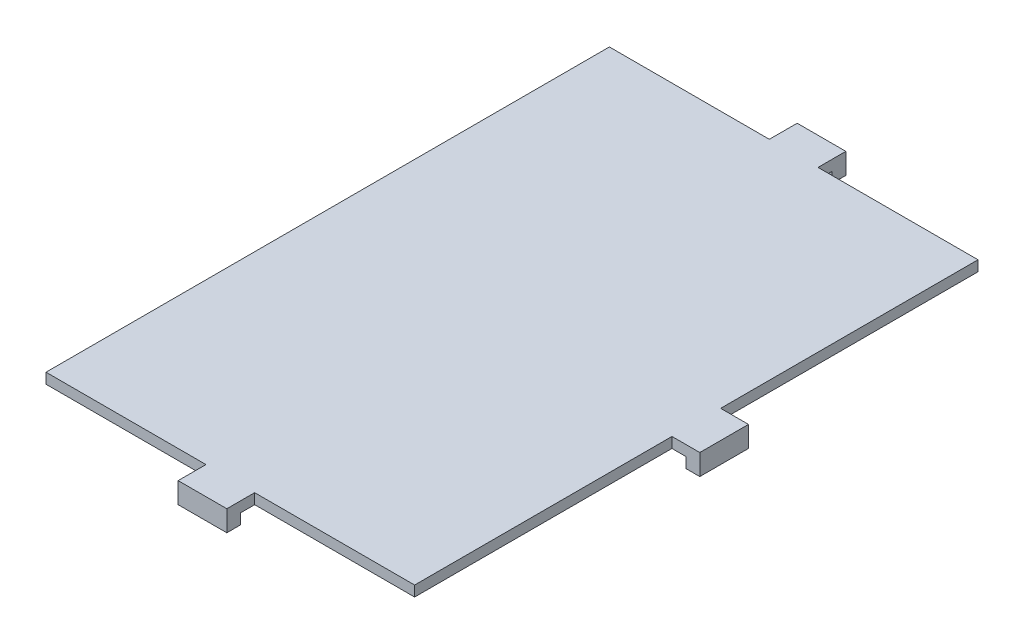
ISO-10303-21;
HEADER;
FILE_DESCRIPTION(('STEP AP214'),'2;1');
FILE_NAME('part.step','',(''),(''),'','','');
FILE_SCHEMA(('AUTOMOTIVE_DESIGN { 1 0 10303 214 1 1 1 1 }'));
ENDSEC;
DATA;
#1=APPLICATION_CONTEXT('core data for automotive mechanical design processes');
#2=APPLICATION_PROTOCOL_DEFINITION('international standard','automotive_design',2000,#1);
#3=PRODUCT_CONTEXT('',#1,'mechanical');
#4=PRODUCT('Part','Part','',(#3));
#5=PRODUCT_RELATED_PRODUCT_CATEGORY('part','',(#4));
#6=PRODUCT_DEFINITION_FORMATION('','',#4);
#7=PRODUCT_DEFINITION_CONTEXT('part definition',#1,'design');
#8=PRODUCT_DEFINITION('design','',#6,#7);
#9=PRODUCT_DEFINITION_SHAPE('','',#8);
#10=(LENGTH_UNIT() NAMED_UNIT(*) SI_UNIT(.MILLI.,.METRE.));
#11=(NAMED_UNIT(*) PLANE_ANGLE_UNIT() SI_UNIT($,.RADIAN.));
#12=(NAMED_UNIT(*) SI_UNIT($,.STERADIAN.) SOLID_ANGLE_UNIT());
#13=UNCERTAINTY_MEASURE_WITH_UNIT(LENGTH_MEASURE(1.E-05),#10,'distance_accuracy_value','');
#14=(GEOMETRIC_REPRESENTATION_CONTEXT(3) GLOBAL_UNCERTAINTY_ASSIGNED_CONTEXT((#13)) GLOBAL_UNIT_ASSIGNED_CONTEXT((#10,
#11,#12)) REPRESENTATION_CONTEXT('',''));
#15=CARTESIAN_POINT('',(0.,0.,0.));
#16=DIRECTION('',(0.,0.,1.));
#17=DIRECTION('',(1.,0.,0.));
#18=AXIS2_PLACEMENT_3D('',#15,#16,#17);
#19=CARTESIAN_POINT('',(0.,1.5,0.));
#20=DIRECTION('',(1.,0.,0.));
#21=DIRECTION('',(0.,0.,-1.));
#22=AXIS2_PLACEMENT_3D('',#19,#20,#21);
#23=PLANE('',#22);
#24=DIRECTION('',(0.,0.,1.));
#25=VECTOR('',#24,1.);
#26=CARTESIAN_POINT('',(0.,0.,0.));
#27=LINE('',#26,#25);
#28=CARTESIAN_POINT('',(0.,0.,-81.));
#29=VERTEX_POINT('',#28);
#30=CARTESIAN_POINT('',(0.,0.,0.));
#31=VERTEX_POINT('',#30);
#32=EDGE_CURVE('E169',#29,#31,#27,.T.);
#33=ORIENTED_EDGE('',*,*,#32,.T.);
#34=DIRECTION('',(0.,-1.,0.));
#35=VECTOR('',#34,1.);
#36=CARTESIAN_POINT('',(0.,1.5,0.));
#37=LINE('',#36,#35);
#38=CARTESIAN_POINT('',(0.,1.5,0.));
#39=VERTEX_POINT('',#38);
#40=EDGE_CURVE('E11',#39,#31,#37,.T.);
#41=ORIENTED_EDGE('',*,*,#40,.F.);
#42=DIRECTION('',(0.,0.,1.));
#43=VECTOR('',#42,1.);
#44=CARTESIAN_POINT('',(0.,1.5,0.));
#45=LINE('',#44,#43);
#46=CARTESIAN_POINT('',(0.,1.5,-81.));
#47=VERTEX_POINT('',#46);
#48=EDGE_CURVE('E203',#47,#39,#45,.T.);
#49=ORIENTED_EDGE('',*,*,#48,.F.);
#50=DIRECTION('',(0.,-1.,0.));
#51=VECTOR('',#50,1.);
#52=CARTESIAN_POINT('',(0.,1.5,-81.));
#53=LINE('',#52,#51);
#54=EDGE_CURVE('E168',#47,#29,#53,.T.);
#55=ORIENTED_EDGE('',*,*,#54,.T.);
#56=EDGE_LOOP('',(#33,#41,#49,#55));
#57=FACE_BOUND('',#56,.T.);
#58=ADVANCED_FACE('F36',(#57),#23,.F.);
#59=CARTESIAN_POINT('',(0.,1.5,0.));
#60=DIRECTION('',(0.,0.,-1.));
#61=DIRECTION('',(-1.,0.,0.));
#62=AXIS2_PLACEMENT_3D('',#59,#60,#61);
#63=PLANE('',#62);
#64=DIRECTION('',(1.,0.,0.));
#65=VECTOR('',#64,1.);
#66=CARTESIAN_POINT('',(0.,0.,0.));
#67=LINE('',#66,#65);
#68=CARTESIAN_POINT('',(23.,0.,0.));
#69=VERTEX_POINT('',#68);
#70=EDGE_CURVE('E172',#31,#69,#67,.T.);
#71=ORIENTED_EDGE('',*,*,#70,.T.);
#72=DIRECTION('',(0.,-1.,0.));
#73=VECTOR('',#72,1.);
#74=CARTESIAN_POINT('',(23.,1.5,0.));
#75=LINE('',#74,#73);
#76=CARTESIAN_POINT('',(23.,1.5,0.));
#77=VERTEX_POINT('',#76);
#78=EDGE_CURVE('E44',#77,#69,#75,.T.);
#79=ORIENTED_EDGE('',*,*,#78,.F.);
#80=DIRECTION('',(1.,0.,0.));
#81=VECTOR('',#80,1.);
#82=CARTESIAN_POINT('',(0.,1.5,0.));
#83=LINE('',#82,#81);
#84=EDGE_CURVE('E111',#39,#77,#83,.T.);
#85=ORIENTED_EDGE('',*,*,#84,.F.);
#86=ORIENTED_EDGE('',*,*,#40,.T.);
#87=EDGE_LOOP('',(#71,#79,#85,#86));
#88=FACE_BOUND('',#87,.T.);
#89=ADVANCED_FACE('F425',(#88),#63,.F.);
#90=CARTESIAN_POINT('',(23.,1.5,0.));
#91=DIRECTION('',(1.,0.,0.));
#92=DIRECTION('',(0.,0.,-1.));
#93=AXIS2_PLACEMENT_3D('',#90,#91,#92);
#94=PLANE('',#93);
#95=DIRECTION('',(0.,0.,1.));
#96=VECTOR('',#95,1.);
#97=CARTESIAN_POINT('',(23.,0.,0.));
#98=LINE('',#97,#96);
#99=CARTESIAN_POINT('',(23.,0.,2.));
#100=VERTEX_POINT('',#99);
#101=EDGE_CURVE('E175',#69,#100,#98,.T.);
#102=ORIENTED_EDGE('',*,*,#101,.T.);
#103=DIRECTION('',(0.,1.,0.));
#104=VECTOR('',#103,1.);
#105=CARTESIAN_POINT('',(23.,-1.5,2.));
#106=LINE('',#105,#104);
#107=CARTESIAN_POINT('',(23.,-1.5,2.));
#108=VERTEX_POINT('',#107);
#109=EDGE_CURVE('E239',#108,#100,#106,.T.);
#110=ORIENTED_EDGE('',*,*,#109,.F.);
#111=DIRECTION('',(0.,0.,1.));
#112=VECTOR('',#111,1.);
#113=CARTESIAN_POINT('',(23.,-1.5,2.));
#114=LINE('',#113,#112);
#115=CARTESIAN_POINT('',(23.,-1.5,4.));
#116=VERTEX_POINT('',#115);
#117=EDGE_CURVE('E590',#108,#116,#114,.T.);
#118=ORIENTED_EDGE('',*,*,#117,.T.);
#119=DIRECTION('',(0.,1.,0.));
#120=VECTOR('',#119,1.);
#121=CARTESIAN_POINT('',(23.,-1.5,4.));
#122=LINE('',#121,#120);
#123=CARTESIAN_POINT('',(23.,1.5,4.));
#124=VERTEX_POINT('',#123);
#125=EDGE_CURVE('E259',#116,#124,#122,.T.);
#126=ORIENTED_EDGE('',*,*,#125,.T.);
#127=DIRECTION('',(0.,0.,1.));
#128=VECTOR('',#127,1.);
#129=CARTESIAN_POINT('',(23.,1.5,0.));
#130=LINE('',#129,#128);
#131=EDGE_CURVE('E227',#77,#124,#130,.T.);
#132=ORIENTED_EDGE('',*,*,#131,.F.);
#133=ORIENTED_EDGE('',*,*,#78,.T.);
#134=EDGE_LOOP('',(#102,#110,#118,#126,#132,#133));
#135=FACE_BOUND('',#134,.T.);
#136=ADVANCED_FACE('F222',(#135),#94,.F.);
#137=CARTESIAN_POINT('',(30.,1.5,0.));
#138=DIRECTION('',(-1.,0.,0.));
#139=DIRECTION('',(0.,0.,1.));
#140=AXIS2_PLACEMENT_3D('',#137,#138,#139);
#141=PLANE('',#140);
#142=DIRECTION('',(0.,0.,-1.));
#143=VECTOR('',#142,1.);
#144=CARTESIAN_POINT('',(30.,0.,0.));
#145=LINE('',#144,#143);
#146=CARTESIAN_POINT('',(30.,0.,2.));
#147=VERTEX_POINT('',#146);
#148=CARTESIAN_POINT('',(30.,0.,0.));
#149=VERTEX_POINT('',#148);
#150=EDGE_CURVE('E180',#147,#149,#145,.T.);
#151=ORIENTED_EDGE('',*,*,#150,.T.);
#152=DIRECTION('',(0.,-1.,0.));
#153=VECTOR('',#152,1.);
#154=CARTESIAN_POINT('',(30.,1.5,0.));
#155=LINE('',#154,#153);
#156=CARTESIAN_POINT('',(30.,1.5,0.));
#157=VERTEX_POINT('',#156);
#158=EDGE_CURVE('E216',#157,#149,#155,.T.);
#159=ORIENTED_EDGE('',*,*,#158,.F.);
#160=DIRECTION('',(0.,0.,-1.));
#161=VECTOR('',#160,1.);
#162=CARTESIAN_POINT('',(30.,1.5,0.));
#163=LINE('',#162,#161);
#164=CARTESIAN_POINT('',(30.,1.5,4.));
#165=VERTEX_POINT('',#164);
#166=EDGE_CURVE('E309',#165,#157,#163,.T.);
#167=ORIENTED_EDGE('',*,*,#166,.F.);
#168=DIRECTION('',(0.,1.,0.));
#169=VECTOR('',#168,1.);
#170=CARTESIAN_POINT('',(30.,-1.5,4.));
#171=LINE('',#170,#169);
#172=CARTESIAN_POINT('',(30.,-1.5,4.));
#173=VERTEX_POINT('',#172);
#174=EDGE_CURVE('E251',#173,#165,#171,.T.);
#175=ORIENTED_EDGE('',*,*,#174,.F.);
#176=DIRECTION('',(0.,0.,-1.));
#177=VECTOR('',#176,1.);
#178=CARTESIAN_POINT('',(30.,-1.5,2.));
#179=LINE('',#178,#177);
#180=CARTESIAN_POINT('',(30.,-1.5,2.));
#181=VERTEX_POINT('',#180);
#182=EDGE_CURVE('E399',#173,#181,#179,.T.);
#183=ORIENTED_EDGE('',*,*,#182,.T.);
#184=DIRECTION('',(0.,1.,0.));
#185=VECTOR('',#184,1.);
#186=CARTESIAN_POINT('',(30.,-1.5,2.));
#187=LINE('',#186,#185);
#188=EDGE_CURVE('E247',#181,#147,#187,.T.);
#189=ORIENTED_EDGE('',*,*,#188,.T.);
#190=EDGE_LOOP('',(#151,#159,#167,#175,#183,#189));
#191=FACE_BOUND('',#190,.T.);
#192=ADVANCED_FACE('F393',(#191),#141,.F.);
#193=CARTESIAN_POINT('',(30.,1.5,0.));
#194=DIRECTION('',(0.,0.,-1.));
#195=DIRECTION('',(-1.,0.,0.));
#196=AXIS2_PLACEMENT_3D('',#193,#194,#195);
#197=PLANE('',#196);
#198=DIRECTION('',(1.,0.,0.));
#199=VECTOR('',#198,1.);
#200=CARTESIAN_POINT('',(30.,0.,0.));
#201=LINE('',#200,#199);
#202=CARTESIAN_POINT('',(53.,0.,0.));
#203=VERTEX_POINT('',#202);
#204=EDGE_CURVE('E182',#149,#203,#201,.T.);
#205=ORIENTED_EDGE('',*,*,#204,.T.);
#206=DIRECTION('',(0.,-1.,0.));
#207=VECTOR('',#206,1.);
#208=CARTESIAN_POINT('',(53.,1.5,0.));
#209=LINE('',#208,#207);
#210=CARTESIAN_POINT('',(53.,1.5,0.));
#211=VERTEX_POINT('',#210);
#212=EDGE_CURVE('E213',#211,#203,#209,.T.);
#213=ORIENTED_EDGE('',*,*,#212,.F.);
#214=DIRECTION('',(1.,0.,0.));
#215=VECTOR('',#214,1.);
#216=CARTESIAN_POINT('',(30.,1.5,0.));
#217=LINE('',#216,#215);
#218=EDGE_CURVE('E311',#157,#211,#217,.T.);
#219=ORIENTED_EDGE('',*,*,#218,.F.);
#220=ORIENTED_EDGE('',*,*,#158,.T.);
#221=EDGE_LOOP('',(#205,#213,#219,#220));
#222=FACE_BOUND('',#221,.T.);
#223=ADVANCED_FACE('F389',(#222),#197,.F.);
#224=CARTESIAN_POINT('',(53.,1.5,0.));
#225=DIRECTION('',(-1.,0.,0.));
#226=DIRECTION('',(0.,0.,1.));
#227=AXIS2_PLACEMENT_3D('',#224,#225,#226);
#228=PLANE('',#227);
#229=DIRECTION('',(0.,0.,-1.));
#230=VECTOR('',#229,1.);
#231=CARTESIAN_POINT('',(53.,0.,0.));
#232=LINE('',#231,#230);
#233=CARTESIAN_POINT('',(53.,0.,-37.));
#234=VERTEX_POINT('',#233);
#235=EDGE_CURVE('E184',#203,#234,#232,.T.);
#236=ORIENTED_EDGE('',*,*,#235,.T.);
#237=DIRECTION('',(0.,-1.,0.));
#238=VECTOR('',#237,1.);
#239=CARTESIAN_POINT('',(53.,1.5,-37.));
#240=LINE('',#239,#238);
#241=CARTESIAN_POINT('',(53.,1.5,-37.));
#242=VERTEX_POINT('',#241);
#243=EDGE_CURVE('E210',#242,#234,#240,.T.);
#244=ORIENTED_EDGE('',*,*,#243,.F.);
#245=DIRECTION('',(0.,0.,-1.));
#246=VECTOR('',#245,1.);
#247=CARTESIAN_POINT('',(53.,1.5,0.));
#248=LINE('',#247,#246);
#249=EDGE_CURVE('E313',#211,#242,#248,.T.);
#250=ORIENTED_EDGE('',*,*,#249,.F.);
#251=ORIENTED_EDGE('',*,*,#212,.T.);
#252=EDGE_LOOP('',(#236,#244,#250,#251));
#253=FACE_BOUND('',#252,.T.);
#254=ADVANCED_FACE('F384',(#253),#228,.F.);
#255=CARTESIAN_POINT('',(53.,1.5,-37.));
#256=DIRECTION('',(0.,0.,-1.));
#257=DIRECTION('',(-1.,0.,0.));
#258=AXIS2_PLACEMENT_3D('',#255,#256,#257);
#259=PLANE('',#258);
#260=DIRECTION('',(1.,0.,0.));
#261=VECTOR('',#260,1.);
#262=CARTESIAN_POINT('',(53.,0.,-37.));
#263=LINE('',#262,#261);
#264=CARTESIAN_POINT('',(55.,0.,-37.));
#265=VERTEX_POINT('',#264);
#266=EDGE_CURVE('E186',#234,#265,#263,.T.);
#267=ORIENTED_EDGE('',*,*,#266,.T.);
#268=DIRECTION('',(0.,1.,0.));
#269=VECTOR('',#268,1.);
#270=CARTESIAN_POINT('',(55.,-1.5,-37.));
#271=LINE('',#270,#269);
#272=CARTESIAN_POINT('',(55.,-1.5,-37.));
#273=VERTEX_POINT('',#272);
#274=EDGE_CURVE('E293',#273,#265,#271,.T.);
#275=ORIENTED_EDGE('',*,*,#274,.F.);
#276=DIRECTION('',(1.,0.,0.));
#277=VECTOR('',#276,1.);
#278=CARTESIAN_POINT('',(55.,-1.5,-37.));
#279=LINE('',#278,#277);
#280=CARTESIAN_POINT('',(57.,-1.5,-37.));
#281=VERTEX_POINT('',#280);
#282=EDGE_CURVE('E284',#273,#281,#279,.T.);
#283=ORIENTED_EDGE('',*,*,#282,.T.);
#284=DIRECTION('',(0.,1.,0.));
#285=VECTOR('',#284,1.);
#286=CARTESIAN_POINT('',(57.,-1.5,-37.));
#287=LINE('',#286,#285);
#288=CARTESIAN_POINT('',(57.,1.5,-37.));
#289=VERTEX_POINT('',#288);
#290=EDGE_CURVE('E301',#281,#289,#287,.T.);
#291=ORIENTED_EDGE('',*,*,#290,.T.);
#292=DIRECTION('',(1.,0.,0.));
#293=VECTOR('',#292,1.);
#294=CARTESIAN_POINT('',(53.,1.5,-37.));
#295=LINE('',#294,#293);
#296=EDGE_CURVE('E315',#242,#289,#295,.T.);
#297=ORIENTED_EDGE('',*,*,#296,.F.);
#298=ORIENTED_EDGE('',*,*,#243,.T.);
#299=EDGE_LOOP('',(#267,#275,#283,#291,#297,#298));
#300=FACE_BOUND('',#299,.T.);
#301=ADVANCED_FACE('F379',(#300),#259,.F.);
#302=CARTESIAN_POINT('',(53.,1.5,-44.));
#303=DIRECTION('',(0.,0.,1.));
#304=DIRECTION('',(1.,0.,0.));
#305=AXIS2_PLACEMENT_3D('',#302,#303,#304);
#306=PLANE('',#305);
#307=DIRECTION('',(-1.,0.,0.));
#308=VECTOR('',#307,1.);
#309=CARTESIAN_POINT('',(53.,0.,-44.));
#310=LINE('',#309,#308);
#311=CARTESIAN_POINT('',(55.,0.,-44.));
#312=VERTEX_POINT('',#311);
#313=CARTESIAN_POINT('',(53.,0.,-44.));
#314=VERTEX_POINT('',#313);
#315=EDGE_CURVE('E191',#312,#314,#310,.T.);
#316=ORIENTED_EDGE('',*,*,#315,.T.);
#317=DIRECTION('',(0.,-1.,0.));
#318=VECTOR('',#317,1.);
#319=CARTESIAN_POINT('',(53.,1.5,-44.));
#320=LINE('',#319,#318);
#321=CARTESIAN_POINT('',(53.,1.5,-44.));
#322=VERTEX_POINT('',#321);
#323=EDGE_CURVE('E207',#322,#314,#320,.T.);
#324=ORIENTED_EDGE('',*,*,#323,.F.);
#325=DIRECTION('',(-1.,0.,0.));
#326=VECTOR('',#325,1.);
#327=CARTESIAN_POINT('',(53.,1.5,-44.));
#328=LINE('',#327,#326);
#329=CARTESIAN_POINT('',(57.,1.5,-44.));
#330=VERTEX_POINT('',#329);
#331=EDGE_CURVE('E318',#330,#322,#328,.T.);
#332=ORIENTED_EDGE('',*,*,#331,.F.);
#333=DIRECTION('',(0.,1.,0.));
#334=VECTOR('',#333,1.);
#335=CARTESIAN_POINT('',(57.,-1.5,-44.));
#336=LINE('',#335,#334);
#337=CARTESIAN_POINT('',(57.,-1.5,-44.));
#338=VERTEX_POINT('',#337);
#339=EDGE_CURVE('E298',#338,#330,#336,.T.);
#340=ORIENTED_EDGE('',*,*,#339,.F.);
#341=DIRECTION('',(-1.,0.,0.));
#342=VECTOR('',#341,1.);
#343=CARTESIAN_POINT('',(55.,-1.5,-44.));
#344=LINE('',#343,#342);
#345=CARTESIAN_POINT('',(55.,-1.5,-44.));
#346=VERTEX_POINT('',#345);
#347=EDGE_CURVE('E290',#338,#346,#344,.T.);
#348=ORIENTED_EDGE('',*,*,#347,.T.);
#349=DIRECTION('',(0.,1.,0.));
#350=VECTOR('',#349,1.);
#351=CARTESIAN_POINT('',(55.,-1.5,-44.));
#352=LINE('',#351,#350);
#353=EDGE_CURVE('E173',#346,#312,#352,.T.);
#354=ORIENTED_EDGE('',*,*,#353,.T.);
#355=EDGE_LOOP('',(#316,#324,#332,#340,#348,#354));
#356=FACE_BOUND('',#355,.T.);
#357=ADVANCED_FACE('F325',(#356),#306,.F.);
#358=CARTESIAN_POINT('',(53.,1.5,-44.));
#359=DIRECTION('',(-1.,0.,0.));
#360=DIRECTION('',(0.,0.,1.));
#361=AXIS2_PLACEMENT_3D('',#358,#359,#360);
#362=PLANE('',#361);
#363=DIRECTION('',(0.,0.,-1.));
#364=VECTOR('',#363,1.);
#365=CARTESIAN_POINT('',(53.,0.,-44.));
#366=LINE('',#365,#364);
#367=CARTESIAN_POINT('',(53.,0.,-81.));
#368=VERTEX_POINT('',#367);
#369=EDGE_CURVE('E193',#314,#368,#366,.T.);
#370=ORIENTED_EDGE('',*,*,#369,.T.);
#371=DIRECTION('',(0.,-1.,0.));
#372=VECTOR('',#371,1.);
#373=CARTESIAN_POINT('',(53.,1.5,-81.));
#374=LINE('',#373,#372);
#375=CARTESIAN_POINT('',(53.,1.5,-81.));
#376=VERTEX_POINT('',#375);
#377=EDGE_CURVE('E154',#376,#368,#374,.T.);
#378=ORIENTED_EDGE('',*,*,#377,.F.);
#379=DIRECTION('',(0.,0.,-1.));
#380=VECTOR('',#379,1.);
#381=CARTESIAN_POINT('',(53.,1.5,-44.));
#382=LINE('',#381,#380);
#383=EDGE_CURVE('E142',#322,#376,#382,.T.);
#384=ORIENTED_EDGE('',*,*,#383,.F.);
#385=ORIENTED_EDGE('',*,*,#323,.T.);
#386=EDGE_LOOP('',(#370,#378,#384,#385));
#387=FACE_BOUND('',#386,.T.);
#388=ADVANCED_FACE('F329',(#387),#362,.F.);
#389=CARTESIAN_POINT('',(30.,1.5,-81.));
#390=DIRECTION('',(0.,0.,1.));
#391=DIRECTION('',(1.,0.,0.));
#392=AXIS2_PLACEMENT_3D('',#389,#390,#391);
#393=PLANE('',#392);
#394=DIRECTION('',(-1.,0.,0.));
#395=VECTOR('',#394,1.);
#396=CARTESIAN_POINT('',(30.,0.,-81.));
#397=LINE('',#396,#395);
#398=CARTESIAN_POINT('',(30.,0.,-81.));
#399=VERTEX_POINT('',#398);
#400=EDGE_CURVE('E151',#368,#399,#397,.T.);
#401=ORIENTED_EDGE('',*,*,#400,.T.);
#402=DIRECTION('',(0.,-1.,0.));
#403=VECTOR('',#402,1.);
#404=CARTESIAN_POINT('',(30.,1.5,-81.));
#405=LINE('',#404,#403);
#406=CARTESIAN_POINT('',(30.,1.5,-81.));
#407=VERTEX_POINT('',#406);
#408=EDGE_CURVE('E148',#407,#399,#405,.T.);
#409=ORIENTED_EDGE('',*,*,#408,.F.);
#410=DIRECTION('',(-1.,0.,0.));
#411=VECTOR('',#410,1.);
#412=CARTESIAN_POINT('',(30.,1.5,-81.));
#413=LINE('',#412,#411);
#414=EDGE_CURVE('E133',#376,#407,#413,.T.);
#415=ORIENTED_EDGE('',*,*,#414,.F.);
#416=ORIENTED_EDGE('',*,*,#377,.T.);
#417=EDGE_LOOP('',(#401,#409,#415,#416));
#418=FACE_BOUND('',#417,.T.);
#419=ADVANCED_FACE('F149',(#418),#393,.F.);
#420=CARTESIAN_POINT('',(30.,1.5,-83.));
#421=DIRECTION('',(-1.,0.,0.));
#422=DIRECTION('',(0.,0.,1.));
#423=AXIS2_PLACEMENT_3D('',#420,#421,#422);
#424=PLANE('',#423);
#425=DIRECTION('',(0.,0.,-1.));
#426=VECTOR('',#425,1.);
#427=CARTESIAN_POINT('',(30.,0.,-83.));
#428=LINE('',#427,#426);
#429=CARTESIAN_POINT('',(30.,0.,-83.));
#430=VERTEX_POINT('',#429);
#431=EDGE_CURVE('E196',#399,#430,#428,.T.);
#432=ORIENTED_EDGE('',*,*,#431,.T.);
#433=DIRECTION('',(0.,1.,0.));
#434=VECTOR('',#433,1.);
#435=CARTESIAN_POINT('',(30.,-1.5,-83.));
#436=LINE('',#435,#434);
#437=CARTESIAN_POINT('',(30.,-1.5,-83.));
#438=VERTEX_POINT('',#437);
#439=EDGE_CURVE('E277',#438,#430,#436,.T.);
#440=ORIENTED_EDGE('',*,*,#439,.F.);
#441=DIRECTION('',(0.,0.,-1.));
#442=VECTOR('',#441,1.);
#443=CARTESIAN_POINT('',(30.,-1.5,-83.));
#444=LINE('',#443,#442);
#445=CARTESIAN_POINT('',(30.,-1.5,-85.));
#446=VERTEX_POINT('',#445);
#447=EDGE_CURVE('E266',#438,#446,#444,.T.);
#448=ORIENTED_EDGE('',*,*,#447,.T.);
#449=DIRECTION('',(0.,1.,0.));
#450=VECTOR('',#449,1.);
#451=CARTESIAN_POINT('',(30.,-1.5,-85.));
#452=LINE('',#451,#450);
#453=CARTESIAN_POINT('',(30.,1.5,-85.));
#454=VERTEX_POINT('',#453);
#455=EDGE_CURVE('E160',#446,#454,#452,.T.);
#456=ORIENTED_EDGE('',*,*,#455,.T.);
#457=DIRECTION('',(0.,0.,-1.));
#458=VECTOR('',#457,1.);
#459=CARTESIAN_POINT('',(30.,1.5,-83.));
#460=LINE('',#459,#458);
#461=EDGE_CURVE('E139',#407,#454,#460,.T.);
#462=ORIENTED_EDGE('',*,*,#461,.F.);
#463=ORIENTED_EDGE('',*,*,#408,.T.);
#464=EDGE_LOOP('',(#432,#440,#448,#456,#462,#463));
#465=FACE_BOUND('',#464,.T.);
#466=ADVANCED_FACE('F157',(#465),#424,.F.);
#467=CARTESIAN_POINT('',(23.,1.5,-83.));
#468=DIRECTION('',(1.,0.,0.));
#469=DIRECTION('',(0.,0.,-1.));
#470=AXIS2_PLACEMENT_3D('',#467,#468,#469);
#471=PLANE('',#470);
#472=DIRECTION('',(0.,0.,1.));
#473=VECTOR('',#472,1.);
#474=CARTESIAN_POINT('',(23.,0.,-83.));
#475=LINE('',#474,#473);
#476=CARTESIAN_POINT('',(23.,0.,-83.));
#477=VERTEX_POINT('',#476);
#478=CARTESIAN_POINT('',(23.,0.,-81.));
#479=VERTEX_POINT('',#478);
#480=EDGE_CURVE('E97',#477,#479,#475,.T.);
#481=ORIENTED_EDGE('',*,*,#480,.T.);
#482=DIRECTION('',(0.,-1.,0.));
#483=VECTOR('',#482,1.);
#484=CARTESIAN_POINT('',(23.,1.5,-81.));
#485=LINE('',#484,#483);
#486=CARTESIAN_POINT('',(23.,1.5,-81.));
#487=VERTEX_POINT('',#486);
#488=EDGE_CURVE('E155',#487,#479,#485,.T.);
#489=ORIENTED_EDGE('',*,*,#488,.F.);
#490=DIRECTION('',(0.,0.,1.));
#491=VECTOR('',#490,1.);
#492=CARTESIAN_POINT('',(23.,1.5,-83.));
#493=LINE('',#492,#491);
#494=CARTESIAN_POINT('',(23.,1.5,-85.));
#495=VERTEX_POINT('',#494);
#496=EDGE_CURVE('E162',#495,#487,#493,.T.);
#497=ORIENTED_EDGE('',*,*,#496,.F.);
#498=DIRECTION('',(0.,1.,0.));
#499=VECTOR('',#498,1.);
#500=CARTESIAN_POINT('',(23.,-1.5,-85.));
#501=LINE('',#500,#499);
#502=CARTESIAN_POINT('',(23.,-1.5,-85.));
#503=VERTEX_POINT('',#502);
#504=EDGE_CURVE('E272',#503,#495,#501,.T.);
#505=ORIENTED_EDGE('',*,*,#504,.F.);
#506=DIRECTION('',(0.,0.,1.));
#507=VECTOR('',#506,1.);
#508=CARTESIAN_POINT('',(23.,-1.5,-83.));
#509=LINE('',#508,#507);
#510=CARTESIAN_POINT('',(23.,-1.5,-83.));
#511=VERTEX_POINT('',#510);
#512=EDGE_CURVE('E249',#503,#511,#509,.T.);
#513=ORIENTED_EDGE('',*,*,#512,.T.);
#514=DIRECTION('',(0.,1.,0.));
#515=VECTOR('',#514,1.);
#516=CARTESIAN_POINT('',(23.,-1.5,-83.));
#517=LINE('',#516,#515);
#518=EDGE_CURVE('E270',#511,#477,#517,.T.);
#519=ORIENTED_EDGE('',*,*,#518,.T.);
#520=EDGE_LOOP('',(#481,#489,#497,#505,#513,#519));
#521=FACE_BOUND('',#520,.T.);
#522=ADVANCED_FACE('F348',(#521),#471,.F.);
#523=CARTESIAN_POINT('',(0.,1.5,-81.));
#524=DIRECTION('',(0.,0.,1.));
#525=DIRECTION('',(1.,0.,0.));
#526=AXIS2_PLACEMENT_3D('',#523,#524,#525);
#527=PLANE('',#526);
#528=DIRECTION('',(-1.,0.,0.));
#529=VECTOR('',#528,1.);
#530=CARTESIAN_POINT('',(0.,0.,-81.));
#531=LINE('',#530,#529);
#532=EDGE_CURVE('E103',#479,#29,#531,.T.);
#533=ORIENTED_EDGE('',*,*,#532,.T.);
#534=ORIENTED_EDGE('',*,*,#54,.F.);
#535=DIRECTION('',(-1.,0.,0.));
#536=VECTOR('',#535,1.);
#537=CARTESIAN_POINT('',(0.,1.5,-81.));
#538=LINE('',#537,#536);
#539=EDGE_CURVE('E52',#487,#47,#538,.T.);
#540=ORIENTED_EDGE('',*,*,#539,.F.);
#541=ORIENTED_EDGE('',*,*,#488,.T.);
#542=EDGE_LOOP('',(#533,#534,#540,#541));
#543=FACE_BOUND('',#542,.T.);
#544=ADVANCED_FACE('F432',(#543),#527,.F.);
#545=CARTESIAN_POINT('',(0.,1.5,0.));
#546=DIRECTION('',(0.,-1.,0.));
#547=DIRECTION('',(0.,0.,-1.));
#548=AXIS2_PLACEMENT_3D('',#545,#546,#547);
#549=PLANE('',#548);
#550=ORIENTED_EDGE('',*,*,#48,.T.);
#551=ORIENTED_EDGE('',*,*,#84,.T.);
#552=ORIENTED_EDGE('',*,*,#131,.T.);
#553=DIRECTION('',(1.,0.,0.));
#554=VECTOR('',#553,1.);
#555=CARTESIAN_POINT('',(23.,1.5,4.));
#556=LINE('',#555,#554);
#557=EDGE_CURVE('E254',#124,#165,#556,.T.);
#558=ORIENTED_EDGE('',*,*,#557,.T.);
#559=ORIENTED_EDGE('',*,*,#166,.T.);
#560=ORIENTED_EDGE('',*,*,#218,.T.);
#561=ORIENTED_EDGE('',*,*,#249,.T.);
#562=ORIENTED_EDGE('',*,*,#296,.T.);
#563=DIRECTION('',(0.,0.,-1.));
#564=VECTOR('',#563,1.);
#565=CARTESIAN_POINT('',(57.,1.5,-44.));
#566=LINE('',#565,#564);
#567=EDGE_CURVE('E275',#289,#330,#566,.T.);
#568=ORIENTED_EDGE('',*,*,#567,.T.);
#569=ORIENTED_EDGE('',*,*,#331,.T.);
#570=ORIENTED_EDGE('',*,*,#383,.T.);
#571=ORIENTED_EDGE('',*,*,#414,.T.);
#572=ORIENTED_EDGE('',*,*,#461,.T.);
#573=DIRECTION('',(-1.,0.,0.));
#574=VECTOR('',#573,1.);
#575=CARTESIAN_POINT('',(23.,1.5,-85.));
#576=LINE('',#575,#574);
#577=EDGE_CURVE('E246',#454,#495,#576,.T.);
#578=ORIENTED_EDGE('',*,*,#577,.T.);
#579=ORIENTED_EDGE('',*,*,#496,.T.);
#580=ORIENTED_EDGE('',*,*,#539,.T.);
#581=EDGE_LOOP('',(#550,#551,#552,#558,#559,#560,#561,#562,#568,#569,#570,#571,#572,#578,#579,#580));
#582=FACE_BOUND('',#581,.T.);
#583=ADVANCED_FACE('F135',(#582),#549,.F.);
#584=CARTESIAN_POINT('',(0.,0.,0.));
#585=DIRECTION('',(0.,-1.,0.));
#586=DIRECTION('',(0.,0.,-1.));
#587=AXIS2_PLACEMENT_3D('',#584,#585,#586);
#588=PLANE('',#587);
#589=ORIENTED_EDGE('',*,*,#32,.F.);
#590=ORIENTED_EDGE('',*,*,#532,.F.);
#591=ORIENTED_EDGE('',*,*,#480,.F.);
#592=DIRECTION('',(-1.,0.,0.));
#593=VECTOR('',#592,1.);
#594=CARTESIAN_POINT('',(23.,0.,-83.));
#595=LINE('',#594,#593);
#596=EDGE_CURVE('E198',#430,#477,#595,.T.);
#597=ORIENTED_EDGE('',*,*,#596,.F.);
#598=ORIENTED_EDGE('',*,*,#431,.F.);
#599=ORIENTED_EDGE('',*,*,#400,.F.);
#600=ORIENTED_EDGE('',*,*,#369,.F.);
#601=ORIENTED_EDGE('',*,*,#315,.F.);
#602=DIRECTION('',(0.,0.,-1.));
#603=VECTOR('',#602,1.);
#604=CARTESIAN_POINT('',(55.,0.,-44.));
#605=LINE('',#604,#603);
#606=EDGE_CURVE('E188',#265,#312,#605,.T.);
#607=ORIENTED_EDGE('',*,*,#606,.F.);
#608=ORIENTED_EDGE('',*,*,#266,.F.);
#609=ORIENTED_EDGE('',*,*,#235,.F.);
#610=ORIENTED_EDGE('',*,*,#204,.F.);
#611=ORIENTED_EDGE('',*,*,#150,.F.);
#612=DIRECTION('',(1.,0.,0.));
#613=VECTOR('',#612,1.);
#614=CARTESIAN_POINT('',(23.,0.,2.));
#615=LINE('',#614,#613);
#616=EDGE_CURVE('E177',#100,#147,#615,.T.);
#617=ORIENTED_EDGE('',*,*,#616,.F.);
#618=ORIENTED_EDGE('',*,*,#101,.F.);
#619=ORIENTED_EDGE('',*,*,#70,.F.);
#620=EDGE_LOOP('',(#589,#590,#591,#597,#598,#599,#600,#601,#607,#608,#609,#610,#611,#617,#618,#619));
#621=FACE_BOUND('',#620,.T.);
#622=ADVANCED_FACE('F230',(#621),#588,.T.);
#623=CARTESIAN_POINT('',(55.,-1.5,-44.));
#624=DIRECTION('',(-1.,0.,0.));
#625=DIRECTION('',(0.,0.,1.));
#626=AXIS2_PLACEMENT_3D('',#623,#624,#625);
#627=PLANE('',#626);
#628=ORIENTED_EDGE('',*,*,#274,.T.);
#629=ORIENTED_EDGE('',*,*,#606,.T.);
#630=ORIENTED_EDGE('',*,*,#353,.F.);
#631=DIRECTION('',(0.,0.,1.));
#632=VECTOR('',#631,1.);
#633=CARTESIAN_POINT('',(55.,-1.5,-44.));
#634=LINE('',#633,#632);
#635=EDGE_CURVE('E281',#346,#273,#634,.T.);
#636=ORIENTED_EDGE('',*,*,#635,.T.);
#637=EDGE_LOOP('',(#628,#629,#630,#636));
#638=FACE_BOUND('',#637,.T.);
#639=ADVANCED_FACE('F372',(#638),#627,.T.);
#640=CARTESIAN_POINT('',(57.,-1.5,-44.));
#641=DIRECTION('',(1.,0.,0.));
#642=DIRECTION('',(0.,0.,-1.));
#643=AXIS2_PLACEMENT_3D('',#640,#641,#642);
#644=PLANE('',#643);
#645=ORIENTED_EDGE('',*,*,#567,.F.);
#646=ORIENTED_EDGE('',*,*,#290,.F.);
#647=DIRECTION('',(0.,0.,-1.));
#648=VECTOR('',#647,1.);
#649=CARTESIAN_POINT('',(57.,-1.5,-44.));
#650=LINE('',#649,#648);
#651=EDGE_CURVE('E287',#281,#338,#650,.T.);
#652=ORIENTED_EDGE('',*,*,#651,.T.);
#653=ORIENTED_EDGE('',*,*,#339,.T.);
#654=EDGE_LOOP('',(#645,#646,#652,#653));
#655=FACE_BOUND('',#654,.T.);
#656=ADVANCED_FACE('F421',(#655),#644,.T.);
#657=CARTESIAN_POINT('',(0.,-1.5,0.));
#658=DIRECTION('',(0.,1.,0.));
#659=DIRECTION('',(0.,0.,1.));
#660=AXIS2_PLACEMENT_3D('',#657,#658,#659);
#661=PLANE('',#660);
#662=ORIENTED_EDGE('',*,*,#635,.F.);
#663=ORIENTED_EDGE('',*,*,#347,.F.);
#664=ORIENTED_EDGE('',*,*,#651,.F.);
#665=ORIENTED_EDGE('',*,*,#282,.F.);
#666=EDGE_LOOP('',(#662,#663,#664,#665));
#667=FACE_BOUND('',#666,.T.);
#668=ADVANCED_FACE('F376',(#667),#661,.F.);
#669=CARTESIAN_POINT('',(23.,-1.5,-85.));
#670=DIRECTION('',(0.,0.,-1.));
#671=DIRECTION('',(-1.,0.,0.));
#672=AXIS2_PLACEMENT_3D('',#669,#670,#671);
#673=PLANE('',#672);
#674=ORIENTED_EDGE('',*,*,#577,.F.);
#675=ORIENTED_EDGE('',*,*,#455,.F.);
#676=DIRECTION('',(-1.,0.,0.));
#677=VECTOR('',#676,1.);
#678=CARTESIAN_POINT('',(23.,-1.5,-85.));
#679=LINE('',#678,#677);
#680=EDGE_CURVE('E268',#446,#503,#679,.T.);
#681=ORIENTED_EDGE('',*,*,#680,.T.);
#682=ORIENTED_EDGE('',*,*,#504,.T.);
#683=EDGE_LOOP('',(#674,#675,#681,#682));
#684=FACE_BOUND('',#683,.T.);
#685=ADVANCED_FACE('F413',(#684),#673,.T.);
#686=CARTESIAN_POINT('',(23.,-1.5,-83.));
#687=DIRECTION('',(0.,0.,1.));
#688=DIRECTION('',(1.,0.,0.));
#689=AXIS2_PLACEMENT_3D('',#686,#687,#688);
#690=PLANE('',#689);
#691=ORIENTED_EDGE('',*,*,#439,.T.);
#692=ORIENTED_EDGE('',*,*,#596,.T.);
#693=ORIENTED_EDGE('',*,*,#518,.F.);
#694=DIRECTION('',(1.,0.,0.));
#695=VECTOR('',#694,1.);
#696=CARTESIAN_POINT('',(23.,-1.5,-83.));
#697=LINE('',#696,#695);
#698=EDGE_CURVE('E263',#511,#438,#697,.T.);
#699=ORIENTED_EDGE('',*,*,#698,.T.);
#700=EDGE_LOOP('',(#691,#692,#693,#699));
#701=FACE_BOUND('',#700,.T.);
#702=ADVANCED_FACE('F344',(#701),#690,.T.);
#703=CARTESIAN_POINT('',(0.,-1.5,0.));
#704=DIRECTION('',(0.,-1.,0.));
#705=DIRECTION('',(0.,0.,-1.));
#706=AXIS2_PLACEMENT_3D('',#703,#704,#705);
#707=PLANE('',#706);
#708=ORIENTED_EDGE('',*,*,#512,.F.);
#709=ORIENTED_EDGE('',*,*,#680,.F.);
#710=ORIENTED_EDGE('',*,*,#447,.F.);
#711=ORIENTED_EDGE('',*,*,#698,.F.);
#712=EDGE_LOOP('',(#708,#709,#710,#711));
#713=FACE_BOUND('',#712,.T.);
#714=ADVANCED_FACE('F342',(#713),#707,.T.);
#715=CARTESIAN_POINT('',(23.,-1.5,2.));
#716=DIRECTION('',(0.,0.,-1.));
#717=DIRECTION('',(-1.,0.,0.));
#718=AXIS2_PLACEMENT_3D('',#715,#716,#717);
#719=PLANE('',#718);
#720=ORIENTED_EDGE('',*,*,#109,.T.);
#721=ORIENTED_EDGE('',*,*,#616,.T.);
#722=ORIENTED_EDGE('',*,*,#188,.F.);
#723=DIRECTION('',(-1.,0.,0.));
#724=VECTOR('',#723,1.);
#725=CARTESIAN_POINT('',(23.,-1.5,2.));
#726=LINE('',#725,#724);
#727=EDGE_CURVE('E243',#181,#108,#726,.T.);
#728=ORIENTED_EDGE('',*,*,#727,.T.);
#729=EDGE_LOOP('',(#720,#721,#722,#728));
#730=FACE_BOUND('',#729,.T.);
#731=ADVANCED_FACE('F240',(#730),#719,.T.);
#732=CARTESIAN_POINT('',(23.,-1.5,4.));
#733=DIRECTION('',(0.,0.,1.));
#734=DIRECTION('',(1.,0.,0.));
#735=AXIS2_PLACEMENT_3D('',#732,#733,#734);
#736=PLANE('',#735);
#737=ORIENTED_EDGE('',*,*,#557,.F.);
#738=ORIENTED_EDGE('',*,*,#125,.F.);
#739=DIRECTION('',(1.,0.,0.));
#740=VECTOR('',#739,1.);
#741=CARTESIAN_POINT('',(23.,-1.5,4.));
#742=LINE('',#741,#740);
#743=EDGE_CURVE('E592',#116,#173,#742,.T.);
#744=ORIENTED_EDGE('',*,*,#743,.T.);
#745=ORIENTED_EDGE('',*,*,#174,.T.);
#746=EDGE_LOOP('',(#737,#738,#744,#745));
#747=FACE_BOUND('',#746,.T.);
#748=ADVANCED_FACE('F566',(#747),#736,.T.);
#749=CARTESIAN_POINT('',(0.,-1.5,0.));
#750=DIRECTION('',(0.,1.,0.));
#751=DIRECTION('',(0.,0.,1.));
#752=AXIS2_PLACEMENT_3D('',#749,#750,#751);
#753=PLANE('',#752);
#754=ORIENTED_EDGE('',*,*,#117,.F.);
#755=ORIENTED_EDGE('',*,*,#727,.F.);
#756=ORIENTED_EDGE('',*,*,#182,.F.);
#757=ORIENTED_EDGE('',*,*,#743,.F.);
#758=EDGE_LOOP('',(#754,#755,#756,#757));
#759=FACE_BOUND('',#758,.T.);
#760=ADVANCED_FACE('F575',(#759),#753,.F.);
#761=CLOSED_SHELL('',(#58,#89,#136,#192,#223,#254,#301,#357,#388,#419,#466,#522,#544,#583,#622,
#639,#656,#668,#685,#702,#714,#731,#748,#760));
#762=MANIFOLD_SOLID_BREP('B2',#761);
#763=ADVANCED_BREP_SHAPE_REPRESENTATION('',(#18,#762),#14);
#764=SHAPE_DEFINITION_REPRESENTATION(#9,#763);
ENDSEC;
END-ISO-10303-21;
